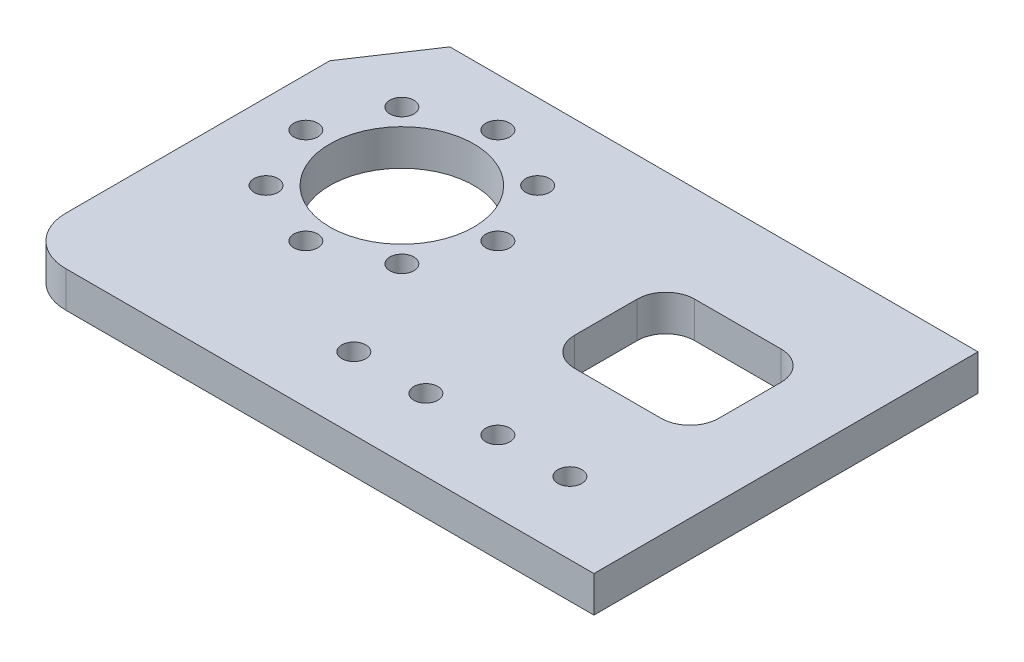
ISO-10303-21;
HEADER;
FILE_DESCRIPTION(('STEP AP214'),'2;1');
FILE_NAME('part.step','',(''),(''),'','','');
FILE_SCHEMA(('AUTOMOTIVE_DESIGN { 1 0 10303 214 1 1 1 1 }'));
ENDSEC;
DATA;
#1=APPLICATION_CONTEXT('core data for automotive mechanical design processes');
#2=APPLICATION_PROTOCOL_DEFINITION('international standard','automotive_design',2000,#1);
#3=PRODUCT_CONTEXT('',#1,'mechanical');
#4=PRODUCT('Part','Part','',(#3));
#5=PRODUCT_RELATED_PRODUCT_CATEGORY('part','',(#4));
#6=PRODUCT_DEFINITION_FORMATION('','',#4);
#7=PRODUCT_DEFINITION_CONTEXT('part definition',#1,'design');
#8=PRODUCT_DEFINITION('design','',#6,#7);
#9=PRODUCT_DEFINITION_SHAPE('','',#8);
#10=(LENGTH_UNIT() NAMED_UNIT(*) SI_UNIT(.MILLI.,.METRE.));
#11=(NAMED_UNIT(*) PLANE_ANGLE_UNIT() SI_UNIT($,.RADIAN.));
#12=(NAMED_UNIT(*) SI_UNIT($,.STERADIAN.) SOLID_ANGLE_UNIT());
#13=UNCERTAINTY_MEASURE_WITH_UNIT(LENGTH_MEASURE(1.E-05),#10,'distance_accuracy_value','');
#14=(GEOMETRIC_REPRESENTATION_CONTEXT(3) GLOBAL_UNCERTAINTY_ASSIGNED_CONTEXT((#13)) GLOBAL_UNIT_ASSIGNED_CONTEXT((#10,
#11,#12)) REPRESENTATION_CONTEXT('',''));
#15=CARTESIAN_POINT('',(0.,0.,0.));
#16=DIRECTION('',(0.,0.,1.));
#17=DIRECTION('',(1.,0.,0.));
#18=AXIS2_PLACEMENT_3D('',#15,#16,#17);
#19=CARTESIAN_POINT('',(12.7,9.525,88.9));
#20=DIRECTION('',(0.,1.,0.));
#21=DIRECTION('',(0.,0.,1.));
#22=AXIS2_PLACEMENT_3D('',#19,#20,#21);
#23=PLANE('',#22);
#24=CARTESIAN_POINT('',(127.,9.525,82.55));
#25=DIRECTION('',(0.,1.,0.));
#26=DIRECTION('',(0.,0.,1.));
#27=AXIS2_PLACEMENT_3D('',#24,#25,#26);
#28=CIRCLE('',#27,3.17499999999997);
#29=CARTESIAN_POINT('',(127.,9.525,85.725));
#30=VERTEX_POINT('',#29);
#31=EDGE_CURVE('E203',#30,#30,#28,.T.);
#32=ORIENTED_EDGE('',*,*,#31,.F.);
#33=EDGE_LOOP('',(#32));
#34=FACE_BOUND('',#33,.T.);
#35=CARTESIAN_POINT('',(88.9,9.525,82.55));
#36=DIRECTION('',(0.,1.,0.));
#37=DIRECTION('',(0.,0.,1.));
#38=AXIS2_PLACEMENT_3D('',#35,#36,#37);
#39=CIRCLE('',#38,3.175);
#40=CARTESIAN_POINT('',(88.9,9.525,85.725));
#41=VERTEX_POINT('',#40);
#42=EDGE_CURVE('E215',#41,#41,#39,.T.);
#43=ORIENTED_EDGE('',*,*,#42,.F.);
#44=EDGE_LOOP('',(#43));
#45=FACE_BOUND('',#44,.T.);
#46=CARTESIAN_POINT('',(56.0605122421383,9.525,20.1394877578617));
#47=DIRECTION('',(0.,1.,0.));
#48=DIRECTION('',(0.,0.,1.));
#49=AXIS2_PLACEMENT_3D('',#46,#47,#48);
#50=CIRCLE('',#49,3.175);
#51=CARTESIAN_POINT('',(56.0605122421383,9.525,23.3144877578617));
#52=VERTEX_POINT('',#51);
#53=EDGE_CURVE('E227',#52,#52,#50,.T.);
#54=ORIENTED_EDGE('',*,*,#53,.F.);
#55=EDGE_LOOP('',(#54));
#56=FACE_BOUND('',#55,.T.);
#57=CARTESIAN_POINT('',(20.1394877578617,9.525,20.1394877578617));
#58=DIRECTION('',(0.,1.,0.));
#59=DIRECTION('',(0.,0.,1.));
#60=AXIS2_PLACEMENT_3D('',#57,#58,#59);
#61=CIRCLE('',#60,3.175);
#62=CARTESIAN_POINT('',(20.1394877578617,9.525,23.3144877578617));
#63=VERTEX_POINT('',#62);
#64=EDGE_CURVE('E239',#63,#63,#61,.T.);
#65=ORIENTED_EDGE('',*,*,#64,.F.);
#66=EDGE_LOOP('',(#65));
#67=FACE_BOUND('',#66,.T.);
#68=CARTESIAN_POINT('',(20.1394877578617,9.525,56.0605122421383));
#69=DIRECTION('',(0.,1.,0.));
#70=DIRECTION('',(0.,0.,1.));
#71=AXIS2_PLACEMENT_3D('',#68,#69,#70);
#72=CIRCLE('',#71,3.175);
#73=CARTESIAN_POINT('',(20.1394877578617,9.525,59.2355122421383));
#74=VERTEX_POINT('',#73);
#75=EDGE_CURVE('E251',#74,#74,#72,.T.);
#76=ORIENTED_EDGE('',*,*,#75,.F.);
#77=EDGE_LOOP('',(#76));
#78=FACE_BOUND('',#77,.T.);
#79=CARTESIAN_POINT('',(69.85,9.525,82.55));
#80=DIRECTION('',(0.,1.,0.));
#81=DIRECTION('',(0.,0.,1.));
#82=AXIS2_PLACEMENT_3D('',#79,#80,#81);
#83=CIRCLE('',#82,3.175);
#84=CARTESIAN_POINT('',(69.85,9.525,85.725));
#85=VERTEX_POINT('',#84);
#86=EDGE_CURVE('E263',#85,#85,#83,.T.);
#87=ORIENTED_EDGE('',*,*,#86,.F.);
#88=EDGE_LOOP('',(#87));
#89=FACE_BOUND('',#88,.T.);
#90=CARTESIAN_POINT('',(38.1,9.525,38.1));
#91=DIRECTION('',(0.,1.,0.));
#92=DIRECTION('',(0.,0.,1.));
#93=AXIS2_PLACEMENT_3D('',#90,#91,#92);
#94=CIRCLE('',#93,19.05);
#95=CARTESIAN_POINT('',(38.1,9.525,57.15));
#96=VERTEX_POINT('',#95);
#97=EDGE_CURVE('E275',#96,#96,#94,.T.);
#98=ORIENTED_EDGE('',*,*,#97,.F.);
#99=EDGE_LOOP('',(#98));
#100=FACE_BOUND('',#99,.T.);
#101=DIRECTION('',(0.,0.,-1.));
#102=VECTOR('',#101,1.);
#103=CARTESIAN_POINT('',(152.4,9.525,0.));
#104=LINE('',#103,#102);
#105=CARTESIAN_POINT('',(152.4,9.525,101.6));
#106=VERTEX_POINT('',#105);
#107=CARTESIAN_POINT('',(152.4,9.525,0.));
#108=VERTEX_POINT('',#107);
#109=EDGE_CURVE('E281',#106,#108,#104,.T.);
#110=ORIENTED_EDGE('',*,*,#109,.T.);
#111=DIRECTION('',(-1.,0.,0.));
#112=VECTOR('',#111,1.);
#113=CARTESIAN_POINT('',(12.7,9.525,0.));
#114=LINE('',#113,#112);
#115=CARTESIAN_POINT('',(12.7,9.525,0.));
#116=VERTEX_POINT('',#115);
#117=EDGE_CURVE('E284',#108,#116,#114,.T.);
#118=ORIENTED_EDGE('',*,*,#117,.T.);
#119=DIRECTION('',(-0.554700196225229,0.,0.832050294337844));
#120=VECTOR('',#119,1.);
#121=CARTESIAN_POINT('',(0.,9.525,19.05));
#122=LINE('',#121,#120);
#123=CARTESIAN_POINT('',(0.,9.525,19.05));
#124=VERTEX_POINT('',#123);
#125=EDGE_CURVE('E287',#116,#124,#122,.T.);
#126=ORIENTED_EDGE('',*,*,#125,.T.);
#127=DIRECTION('',(0.,0.,1.));
#128=VECTOR('',#127,1.);
#129=CARTESIAN_POINT('',(0.,9.525,19.05));
#130=LINE('',#129,#128);
#131=CARTESIAN_POINT('',(0.,9.525,88.9));
#132=VERTEX_POINT('',#131);
#133=EDGE_CURVE('E289',#124,#132,#130,.T.);
#134=ORIENTED_EDGE('',*,*,#133,.T.);
#135=CARTESIAN_POINT('',(12.7,9.525,88.9));
#136=DIRECTION('',(0.,1.,0.));
#137=DIRECTION('',(0.,0.,1.));
#138=AXIS2_PLACEMENT_3D('',#135,#136,#137);
#139=CIRCLE('',#138,12.7);
#140=CARTESIAN_POINT('',(12.7,9.525,101.6));
#141=VERTEX_POINT('',#140);
#142=EDGE_CURVE('E291',#132,#141,#139,.T.);
#143=ORIENTED_EDGE('',*,*,#142,.T.);
#144=DIRECTION('',(1.,0.,0.));
#145=VECTOR('',#144,1.);
#146=CARTESIAN_POINT('',(12.7,9.525,101.6));
#147=LINE('',#146,#145);
#148=EDGE_CURVE('E293',#141,#106,#147,.T.);
#149=ORIENTED_EDGE('',*,*,#148,.T.);
#150=EDGE_LOOP('',(#110,#118,#126,#134,#143,#149));
#151=FACE_BOUND('',#150,.T.);
#152=CARTESIAN_POINT('',(56.0605122421383,9.525,56.0605122421383));
#153=DIRECTION('',(0.,1.,0.));
#154=DIRECTION('',(0.,0.,1.));
#155=AXIS2_PLACEMENT_3D('',#152,#153,#154);
#156=CIRCLE('',#155,3.175);
#157=CARTESIAN_POINT('',(56.0605122421383,9.525,59.2355122421383));
#158=VERTEX_POINT('',#157);
#159=EDGE_CURVE('E269',#158,#158,#156,.T.);
#160=ORIENTED_EDGE('',*,*,#159,.F.);
#161=EDGE_LOOP('',(#160));
#162=FACE_BOUND('',#161,.T.);
#163=CARTESIAN_POINT('',(38.1,9.525,63.5));
#164=DIRECTION('',(0.,1.,0.));
#165=DIRECTION('',(0.,0.,1.));
#166=AXIS2_PLACEMENT_3D('',#163,#164,#165);
#167=CIRCLE('',#166,3.175);
#168=CARTESIAN_POINT('',(38.1,9.525,66.675));
#169=VERTEX_POINT('',#168);
#170=EDGE_CURVE('E257',#169,#169,#167,.T.);
#171=ORIENTED_EDGE('',*,*,#170,.F.);
#172=EDGE_LOOP('',(#171));
#173=FACE_BOUND('',#172,.T.);
#174=CARTESIAN_POINT('',(12.7,9.525,38.1));
#175=DIRECTION('',(0.,1.,0.));
#176=DIRECTION('',(0.,0.,1.));
#177=AXIS2_PLACEMENT_3D('',#174,#175,#176);
#178=CIRCLE('',#177,3.175);
#179=CARTESIAN_POINT('',(12.7,9.525,41.275));
#180=VERTEX_POINT('',#179);
#181=EDGE_CURVE('E245',#180,#180,#178,.T.);
#182=ORIENTED_EDGE('',*,*,#181,.F.);
#183=EDGE_LOOP('',(#182));
#184=FACE_BOUND('',#183,.T.);
#185=CARTESIAN_POINT('',(38.1,9.525,12.7));
#186=DIRECTION('',(0.,1.,0.));
#187=DIRECTION('',(0.,0.,1.));
#188=AXIS2_PLACEMENT_3D('',#185,#186,#187);
#189=CIRCLE('',#188,3.175);
#190=CARTESIAN_POINT('',(38.1,9.525,15.875));
#191=VERTEX_POINT('',#190);
#192=EDGE_CURVE('E233',#191,#191,#189,.T.);
#193=ORIENTED_EDGE('',*,*,#192,.F.);
#194=EDGE_LOOP('',(#193));
#195=FACE_BOUND('',#194,.T.);
#196=CARTESIAN_POINT('',(63.5,9.525,38.1));
#197=DIRECTION('',(0.,1.,0.));
#198=DIRECTION('',(0.,0.,1.));
#199=AXIS2_PLACEMENT_3D('',#196,#197,#198);
#200=CIRCLE('',#199,3.175);
#201=CARTESIAN_POINT('',(63.5,9.525,41.275));
#202=VERTEX_POINT('',#201);
#203=EDGE_CURVE('E221',#202,#202,#200,.T.);
#204=ORIENTED_EDGE('',*,*,#203,.F.);
#205=EDGE_LOOP('',(#204));
#206=FACE_BOUND('',#205,.T.);
#207=CARTESIAN_POINT('',(107.95,9.525,82.55));
#208=DIRECTION('',(0.,1.,0.));
#209=DIRECTION('',(0.,0.,1.));
#210=AXIS2_PLACEMENT_3D('',#207,#208,#209);
#211=CIRCLE('',#210,3.175);
#212=CARTESIAN_POINT('',(107.95,9.525,85.725));
#213=VERTEX_POINT('',#212);
#214=EDGE_CURVE('E209',#213,#213,#211,.T.);
#215=ORIENTED_EDGE('',*,*,#214,.F.);
#216=EDGE_LOOP('',(#215));
#217=FACE_BOUND('',#216,.T.);
#218=DIRECTION('',(1.,0.,0.));
#219=VECTOR('',#218,1.);
#220=CARTESIAN_POINT('',(102.87,9.525,57.15));
#221=LINE('',#220,#219);
#222=CARTESIAN_POINT('',(102.87,9.525,57.15));
#223=VERTEX_POINT('',#222);
#224=CARTESIAN_POINT('',(125.73,9.525,57.15));
#225=VERTEX_POINT('',#224);
#226=EDGE_CURVE('E146',#223,#225,#221,.T.);
#227=ORIENTED_EDGE('',*,*,#226,.F.);
#228=CARTESIAN_POINT('',(102.87,9.525,49.53));
#229=DIRECTION('',(0.,1.,0.));
#230=DIRECTION('',(0.,0.,1.));
#231=AXIS2_PLACEMENT_3D('',#228,#229,#230);
#232=CIRCLE('',#231,7.62);
#233=CARTESIAN_POINT('',(95.25,9.525,49.53));
#234=VERTEX_POINT('',#233);
#235=EDGE_CURVE('E138',#234,#223,#232,.T.);
#236=ORIENTED_EDGE('',*,*,#235,.F.);
#237=DIRECTION('',(0.,0.,1.));
#238=VECTOR('',#237,1.);
#239=CARTESIAN_POINT('',(95.25,9.525,33.02));
#240=LINE('',#239,#238);
#241=CARTESIAN_POINT('',(95.25,9.525,33.02));
#242=VERTEX_POINT('',#241);
#243=EDGE_CURVE('E171',#242,#234,#240,.T.);
#244=ORIENTED_EDGE('',*,*,#243,.F.);
#245=CARTESIAN_POINT('',(102.87,9.525,33.02));
#246=DIRECTION('',(0.,1.,0.));
#247=DIRECTION('',(0.,0.,1.));
#248=AXIS2_PLACEMENT_3D('',#245,#246,#247);
#249=CIRCLE('',#248,7.62000000000001);
#250=CARTESIAN_POINT('',(102.87,9.525,25.4));
#251=VERTEX_POINT('',#250);
#252=EDGE_CURVE('E169',#251,#242,#249,.T.);
#253=ORIENTED_EDGE('',*,*,#252,.F.);
#254=DIRECTION('',(-1.,0.,0.));
#255=VECTOR('',#254,1.);
#256=CARTESIAN_POINT('',(102.87,9.525,25.4));
#257=LINE('',#256,#255);
#258=CARTESIAN_POINT('',(125.73,9.525,25.4));
#259=VERTEX_POINT('',#258);
#260=EDGE_CURVE('E167',#259,#251,#257,.T.);
#261=ORIENTED_EDGE('',*,*,#260,.F.);
#262=CARTESIAN_POINT('',(125.73,9.525,33.02));
#263=DIRECTION('',(0.,1.,0.));
#264=DIRECTION('',(0.,0.,-1.));
#265=AXIS2_PLACEMENT_3D('',#262,#263,#264);
#266=CIRCLE('',#265,7.62000000000001);
#267=CARTESIAN_POINT('',(133.35,9.525,33.02));
#268=VERTEX_POINT('',#267);
#269=EDGE_CURVE('E165',#268,#259,#266,.T.);
#270=ORIENTED_EDGE('',*,*,#269,.F.);
#271=DIRECTION('',(0.,0.,-1.));
#272=VECTOR('',#271,1.);
#273=CARTESIAN_POINT('',(133.35,9.525,33.02));
#274=LINE('',#273,#272);
#275=CARTESIAN_POINT('',(133.35,9.525,49.53));
#276=VERTEX_POINT('',#275);
#277=EDGE_CURVE('E161',#276,#268,#274,.T.);
#278=ORIENTED_EDGE('',*,*,#277,.F.);
#279=CARTESIAN_POINT('',(125.73,9.525,49.53));
#280=DIRECTION('',(0.,1.,0.));
#281=DIRECTION('',(0.,0.,1.));
#282=AXIS2_PLACEMENT_3D('',#279,#280,#281);
#283=CIRCLE('',#282,7.62000000000001);
#284=EDGE_CURVE('E159',#225,#276,#283,.T.);
#285=ORIENTED_EDGE('',*,*,#284,.F.);
#286=EDGE_LOOP('',(#227,#236,#244,#253,#261,#270,#278,#285));
#287=FACE_BOUND('',#286,.T.);
#288=ADVANCED_FACE('F37',(#34,#45,#56,#67,#78,#89,#100,#151,#162,#173,#184,#195,#206,#217,#287),
#23,.T.);
#289=CARTESIAN_POINT('',(12.7,0.,88.9));
#290=DIRECTION('',(0.,1.,0.));
#291=DIRECTION('',(0.,0.,1.));
#292=AXIS2_PLACEMENT_3D('',#289,#290,#291);
#293=PLANE('',#292);
#294=CARTESIAN_POINT('',(127.,0.,82.55));
#295=DIRECTION('',(0.,1.,0.));
#296=DIRECTION('',(0.,0.,1.));
#297=AXIS2_PLACEMENT_3D('',#294,#295,#296);
#298=CIRCLE('',#297,3.17499999999997);
#299=CARTESIAN_POINT('',(127.,0.,85.725));
#300=VERTEX_POINT('',#299);
#301=EDGE_CURVE('E154',#300,#300,#298,.T.);
#302=ORIENTED_EDGE('',*,*,#301,.T.);
#303=EDGE_LOOP('',(#302));
#304=FACE_BOUND('',#303,.T.);
#305=CARTESIAN_POINT('',(88.9,0.,82.55));
#306=DIRECTION('',(0.,1.,0.));
#307=DIRECTION('',(0.,0.,1.));
#308=AXIS2_PLACEMENT_3D('',#305,#306,#307);
#309=CIRCLE('',#308,3.175);
#310=CARTESIAN_POINT('',(88.9,0.,85.725));
#311=VERTEX_POINT('',#310);
#312=EDGE_CURVE('E212',#311,#311,#309,.T.);
#313=ORIENTED_EDGE('',*,*,#312,.T.);
#314=EDGE_LOOP('',(#313));
#315=FACE_BOUND('',#314,.T.);
#316=CARTESIAN_POINT('',(56.0605122421383,0.,20.1394877578617));
#317=DIRECTION('',(0.,1.,0.));
#318=DIRECTION('',(0.,0.,1.));
#319=AXIS2_PLACEMENT_3D('',#316,#317,#318);
#320=CIRCLE('',#319,3.175);
#321=CARTESIAN_POINT('',(56.0605122421383,0.,23.3144877578617));
#322=VERTEX_POINT('',#321);
#323=EDGE_CURVE('E224',#322,#322,#320,.T.);
#324=ORIENTED_EDGE('',*,*,#323,.T.);
#325=EDGE_LOOP('',(#324));
#326=FACE_BOUND('',#325,.T.);
#327=CARTESIAN_POINT('',(20.1394877578617,0.,20.1394877578617));
#328=DIRECTION('',(0.,1.,0.));
#329=DIRECTION('',(0.,0.,1.));
#330=AXIS2_PLACEMENT_3D('',#327,#328,#329);
#331=CIRCLE('',#330,3.175);
#332=CARTESIAN_POINT('',(20.1394877578617,0.,23.3144877578617));
#333=VERTEX_POINT('',#332);
#334=EDGE_CURVE('E236',#333,#333,#331,.T.);
#335=ORIENTED_EDGE('',*,*,#334,.T.);
#336=EDGE_LOOP('',(#335));
#337=FACE_BOUND('',#336,.T.);
#338=CARTESIAN_POINT('',(20.1394877578617,0.,56.0605122421383));
#339=DIRECTION('',(0.,1.,0.));
#340=DIRECTION('',(0.,0.,1.));
#341=AXIS2_PLACEMENT_3D('',#338,#339,#340);
#342=CIRCLE('',#341,3.175);
#343=CARTESIAN_POINT('',(20.1394877578617,0.,59.2355122421383));
#344=VERTEX_POINT('',#343);
#345=EDGE_CURVE('E248',#344,#344,#342,.T.);
#346=ORIENTED_EDGE('',*,*,#345,.T.);
#347=EDGE_LOOP('',(#346));
#348=FACE_BOUND('',#347,.T.);
#349=CARTESIAN_POINT('',(69.85,0.,82.55));
#350=DIRECTION('',(0.,1.,0.));
#351=DIRECTION('',(0.,0.,1.));
#352=AXIS2_PLACEMENT_3D('',#349,#350,#351);
#353=CIRCLE('',#352,3.175);
#354=CARTESIAN_POINT('',(69.85,0.,85.725));
#355=VERTEX_POINT('',#354);
#356=EDGE_CURVE('E260',#355,#355,#353,.T.);
#357=ORIENTED_EDGE('',*,*,#356,.T.);
#358=EDGE_LOOP('',(#357));
#359=FACE_BOUND('',#358,.T.);
#360=CARTESIAN_POINT('',(38.1,0.,38.1));
#361=DIRECTION('',(0.,1.,0.));
#362=DIRECTION('',(0.,0.,1.));
#363=AXIS2_PLACEMENT_3D('',#360,#361,#362);
#364=CIRCLE('',#363,19.05);
#365=CARTESIAN_POINT('',(38.1,0.,57.15));
#366=VERTEX_POINT('',#365);
#367=EDGE_CURVE('E272',#366,#366,#364,.T.);
#368=ORIENTED_EDGE('',*,*,#367,.T.);
#369=EDGE_LOOP('',(#368));
#370=FACE_BOUND('',#369,.T.);
#371=DIRECTION('',(0.,0.,-1.));
#372=VECTOR('',#371,1.);
#373=CARTESIAN_POINT('',(152.4,0.,0.));
#374=LINE('',#373,#372);
#375=CARTESIAN_POINT('',(152.4,0.,101.6));
#376=VERTEX_POINT('',#375);
#377=CARTESIAN_POINT('',(152.4,0.,0.));
#378=VERTEX_POINT('',#377);
#379=EDGE_CURVE('E278',#376,#378,#374,.T.);
#380=ORIENTED_EDGE('',*,*,#379,.F.);
#381=DIRECTION('',(1.,0.,0.));
#382=VECTOR('',#381,1.);
#383=CARTESIAN_POINT('',(12.7,0.,101.6));
#384=LINE('',#383,#382);
#385=CARTESIAN_POINT('',(12.7,0.,101.6));
#386=VERTEX_POINT('',#385);
#387=EDGE_CURVE('E285',#386,#376,#384,.T.);
#388=ORIENTED_EDGE('',*,*,#387,.F.);
#389=CARTESIAN_POINT('',(12.7,0.,88.9));
#390=DIRECTION('',(0.,1.,0.));
#391=DIRECTION('',(0.,0.,1.));
#392=AXIS2_PLACEMENT_3D('',#389,#390,#391);
#393=CIRCLE('',#392,12.7);
#394=CARTESIAN_POINT('',(0.,0.,88.9));
#395=VERTEX_POINT('',#394);
#396=EDGE_CURVE('E304',#395,#386,#393,.T.);
#397=ORIENTED_EDGE('',*,*,#396,.F.);
#398=DIRECTION('',(0.,0.,1.));
#399=VECTOR('',#398,1.);
#400=CARTESIAN_POINT('',(0.,0.,19.05));
#401=LINE('',#400,#399);
#402=CARTESIAN_POINT('',(0.,0.,19.05));
#403=VERTEX_POINT('',#402);
#404=EDGE_CURVE('E302',#403,#395,#401,.T.);
#405=ORIENTED_EDGE('',*,*,#404,.F.);
#406=DIRECTION('',(-0.554700196225229,0.,0.832050294337844));
#407=VECTOR('',#406,1.);
#408=CARTESIAN_POINT('',(0.,0.,19.05));
#409=LINE('',#408,#407);
#410=CARTESIAN_POINT('',(12.7,0.,0.));
#411=VERTEX_POINT('',#410);
#412=EDGE_CURVE('E300',#411,#403,#409,.T.);
#413=ORIENTED_EDGE('',*,*,#412,.F.);
#414=DIRECTION('',(-1.,0.,0.));
#415=VECTOR('',#414,1.);
#416=CARTESIAN_POINT('',(12.7,0.,0.));
#417=LINE('',#416,#415);
#418=EDGE_CURVE('E298',#378,#411,#417,.T.);
#419=ORIENTED_EDGE('',*,*,#418,.F.);
#420=EDGE_LOOP('',(#380,#388,#397,#405,#413,#419));
#421=FACE_BOUND('',#420,.T.);
#422=CARTESIAN_POINT('',(56.0605122421383,0.,56.0605122421383));
#423=DIRECTION('',(0.,1.,0.));
#424=DIRECTION('',(0.,0.,1.));
#425=AXIS2_PLACEMENT_3D('',#422,#423,#424);
#426=CIRCLE('',#425,3.175);
#427=CARTESIAN_POINT('',(56.0605122421383,0.,59.2355122421383));
#428=VERTEX_POINT('',#427);
#429=EDGE_CURVE('E266',#428,#428,#426,.T.);
#430=ORIENTED_EDGE('',*,*,#429,.T.);
#431=EDGE_LOOP('',(#430));
#432=FACE_BOUND('',#431,.T.);
#433=CARTESIAN_POINT('',(38.1,0.,63.5));
#434=DIRECTION('',(0.,1.,0.));
#435=DIRECTION('',(0.,0.,1.));
#436=AXIS2_PLACEMENT_3D('',#433,#434,#435);
#437=CIRCLE('',#436,3.175);
#438=CARTESIAN_POINT('',(38.1,0.,66.675));
#439=VERTEX_POINT('',#438);
#440=EDGE_CURVE('E254',#439,#439,#437,.T.);
#441=ORIENTED_EDGE('',*,*,#440,.T.);
#442=EDGE_LOOP('',(#441));
#443=FACE_BOUND('',#442,.T.);
#444=CARTESIAN_POINT('',(12.7,0.,38.1));
#445=DIRECTION('',(0.,1.,0.));
#446=DIRECTION('',(0.,0.,1.));
#447=AXIS2_PLACEMENT_3D('',#444,#445,#446);
#448=CIRCLE('',#447,3.175);
#449=CARTESIAN_POINT('',(12.7,0.,41.275));
#450=VERTEX_POINT('',#449);
#451=EDGE_CURVE('E242',#450,#450,#448,.T.);
#452=ORIENTED_EDGE('',*,*,#451,.T.);
#453=EDGE_LOOP('',(#452));
#454=FACE_BOUND('',#453,.T.);
#455=CARTESIAN_POINT('',(38.1,0.,12.7));
#456=DIRECTION('',(0.,1.,0.));
#457=DIRECTION('',(0.,0.,1.));
#458=AXIS2_PLACEMENT_3D('',#455,#456,#457);
#459=CIRCLE('',#458,3.175);
#460=CARTESIAN_POINT('',(38.1,0.,15.875));
#461=VERTEX_POINT('',#460);
#462=EDGE_CURVE('E230',#461,#461,#459,.T.);
#463=ORIENTED_EDGE('',*,*,#462,.T.);
#464=EDGE_LOOP('',(#463));
#465=FACE_BOUND('',#464,.T.);
#466=CARTESIAN_POINT('',(63.5,0.,38.1));
#467=DIRECTION('',(0.,1.,0.));
#468=DIRECTION('',(0.,0.,1.));
#469=AXIS2_PLACEMENT_3D('',#466,#467,#468);
#470=CIRCLE('',#469,3.175);
#471=CARTESIAN_POINT('',(63.5,0.,41.275));
#472=VERTEX_POINT('',#471);
#473=EDGE_CURVE('E218',#472,#472,#470,.T.);
#474=ORIENTED_EDGE('',*,*,#473,.T.);
#475=EDGE_LOOP('',(#474));
#476=FACE_BOUND('',#475,.T.);
#477=CARTESIAN_POINT('',(107.95,0.,82.55));
#478=DIRECTION('',(0.,1.,0.));
#479=DIRECTION('',(0.,0.,1.));
#480=AXIS2_PLACEMENT_3D('',#477,#478,#479);
#481=CIRCLE('',#480,3.175);
#482=CARTESIAN_POINT('',(107.95,0.,85.725));
#483=VERTEX_POINT('',#482);
#484=EDGE_CURVE('E206',#483,#483,#481,.T.);
#485=ORIENTED_EDGE('',*,*,#484,.T.);
#486=EDGE_LOOP('',(#485));
#487=FACE_BOUND('',#486,.T.);
#488=CARTESIAN_POINT('',(102.87,0.,49.53));
#489=DIRECTION('',(0.,1.,0.));
#490=DIRECTION('',(0.,0.,1.));
#491=AXIS2_PLACEMENT_3D('',#488,#489,#490);
#492=CIRCLE('',#491,7.62);
#493=CARTESIAN_POINT('',(95.25,0.,49.53));
#494=VERTEX_POINT('',#493);
#495=CARTESIAN_POINT('',(102.87,0.,57.15));
#496=VERTEX_POINT('',#495);
#497=EDGE_CURVE('E60',#494,#496,#492,.T.);
#498=ORIENTED_EDGE('',*,*,#497,.T.);
#499=DIRECTION('',(1.,0.,0.));
#500=VECTOR('',#499,1.);
#501=CARTESIAN_POINT('',(102.87,0.,57.15));
#502=LINE('',#501,#500);
#503=CARTESIAN_POINT('',(125.73,0.,57.15));
#504=VERTEX_POINT('',#503);
#505=EDGE_CURVE('E153',#496,#504,#502,.T.);
#506=ORIENTED_EDGE('',*,*,#505,.T.);
#507=CARTESIAN_POINT('',(125.73,0.,49.53));
#508=DIRECTION('',(0.,1.,0.));
#509=DIRECTION('',(0.,0.,1.));
#510=AXIS2_PLACEMENT_3D('',#507,#508,#509);
#511=CIRCLE('',#510,7.62000000000001);
#512=CARTESIAN_POINT('',(133.35,0.,49.53));
#513=VERTEX_POINT('',#512);
#514=EDGE_CURVE('E175',#504,#513,#511,.T.);
#515=ORIENTED_EDGE('',*,*,#514,.T.);
#516=DIRECTION('',(0.,0.,-1.));
#517=VECTOR('',#516,1.);
#518=CARTESIAN_POINT('',(133.35,0.,33.02));
#519=LINE('',#518,#517);
#520=CARTESIAN_POINT('',(133.35,0.,33.02));
#521=VERTEX_POINT('',#520);
#522=EDGE_CURVE('E178',#513,#521,#519,.T.);
#523=ORIENTED_EDGE('',*,*,#522,.T.);
#524=CARTESIAN_POINT('',(125.73,0.,33.02));
#525=DIRECTION('',(0.,1.,0.));
#526=DIRECTION('',(0.,0.,-1.));
#527=AXIS2_PLACEMENT_3D('',#524,#525,#526);
#528=CIRCLE('',#527,7.62000000000001);
#529=CARTESIAN_POINT('',(125.73,0.,25.4));
#530=VERTEX_POINT('',#529);
#531=EDGE_CURVE('E181',#521,#530,#528,.T.);
#532=ORIENTED_EDGE('',*,*,#531,.T.);
#533=DIRECTION('',(-1.,0.,0.));
#534=VECTOR('',#533,1.);
#535=CARTESIAN_POINT('',(102.87,0.,25.4));
#536=LINE('',#535,#534);
#537=CARTESIAN_POINT('',(102.87,0.,25.4));
#538=VERTEX_POINT('',#537);
#539=EDGE_CURVE('E184',#530,#538,#536,.T.);
#540=ORIENTED_EDGE('',*,*,#539,.T.);
#541=CARTESIAN_POINT('',(102.87,0.,33.02));
#542=DIRECTION('',(0.,1.,0.));
#543=DIRECTION('',(0.,0.,1.));
#544=AXIS2_PLACEMENT_3D('',#541,#542,#543);
#545=CIRCLE('',#544,7.62000000000001);
#546=CARTESIAN_POINT('',(95.25,0.,33.02));
#547=VERTEX_POINT('',#546);
#548=EDGE_CURVE('E187',#538,#547,#545,.T.);
#549=ORIENTED_EDGE('',*,*,#548,.T.);
#550=DIRECTION('',(0.,0.,1.));
#551=VECTOR('',#550,1.);
#552=CARTESIAN_POINT('',(95.25,0.,33.02));
#553=LINE('',#552,#551);
#554=EDGE_CURVE('E147',#547,#494,#553,.T.);
#555=ORIENTED_EDGE('',*,*,#554,.T.);
#556=EDGE_LOOP('',(#498,#506,#515,#523,#532,#540,#549,#555));
#557=FACE_BOUND('',#556,.T.);
#558=ADVANCED_FACE('F328',(#304,#315,#326,#337,#348,#359,#370,#421,#432,#443,#454,#465,#476,
#487,#557),#293,.F.);
#559=CARTESIAN_POINT('',(152.4,9.525,0.));
#560=DIRECTION('',(-1.,0.,0.));
#561=DIRECTION('',(0.,0.,1.));
#562=AXIS2_PLACEMENT_3D('',#559,#560,#561);
#563=PLANE('',#562);
#564=ORIENTED_EDGE('',*,*,#379,.T.);
#565=DIRECTION('',(0.,-1.,0.));
#566=VECTOR('',#565,1.);
#567=CARTESIAN_POINT('',(152.4,9.525,0.));
#568=LINE('',#567,#566);
#569=EDGE_CURVE('E11',#108,#378,#568,.T.);
#570=ORIENTED_EDGE('',*,*,#569,.F.);
#571=ORIENTED_EDGE('',*,*,#109,.F.);
#572=DIRECTION('',(0.,-1.,0.));
#573=VECTOR('',#572,1.);
#574=CARTESIAN_POINT('',(152.4,9.525,101.6));
#575=LINE('',#574,#573);
#576=EDGE_CURVE('E295',#106,#376,#575,.T.);
#577=ORIENTED_EDGE('',*,*,#576,.T.);
#578=EDGE_LOOP('',(#564,#570,#571,#577));
#579=FACE_BOUND('',#578,.T.);
#580=ADVANCED_FACE('F39',(#579),#563,.F.);
#581=CARTESIAN_POINT('',(12.7,9.525,0.));
#582=DIRECTION('',(0.,0.,1.));
#583=DIRECTION('',(1.,0.,0.));
#584=AXIS2_PLACEMENT_3D('',#581,#582,#583);
#585=PLANE('',#584);
#586=ORIENTED_EDGE('',*,*,#418,.T.);
#587=DIRECTION('',(0.,-1.,0.));
#588=VECTOR('',#587,1.);
#589=CARTESIAN_POINT('',(12.7,9.525,0.));
#590=LINE('',#589,#588);
#591=EDGE_CURVE('E45',#116,#411,#590,.T.);
#592=ORIENTED_EDGE('',*,*,#591,.F.);
#593=ORIENTED_EDGE('',*,*,#117,.F.);
#594=ORIENTED_EDGE('',*,*,#569,.T.);
#595=EDGE_LOOP('',(#586,#592,#593,#594));
#596=FACE_BOUND('',#595,.T.);
#597=ADVANCED_FACE('F346',(#596),#585,.F.);
#598=CARTESIAN_POINT('',(0.,9.525,19.05));
#599=DIRECTION('',(0.832050294337844,0.,0.554700196225229));
#600=DIRECTION('',(0.554700196225229,0.,-0.832050294337844));
#601=AXIS2_PLACEMENT_3D('',#598,#599,#600);
#602=PLANE('',#601);
#603=ORIENTED_EDGE('',*,*,#412,.T.);
#604=DIRECTION('',(0.,-1.,0.));
#605=VECTOR('',#604,1.);
#606=CARTESIAN_POINT('',(0.,9.525,19.05));
#607=LINE('',#606,#605);
#608=EDGE_CURVE('E315',#124,#403,#607,.T.);
#609=ORIENTED_EDGE('',*,*,#608,.F.);
#610=ORIENTED_EDGE('',*,*,#125,.F.);
#611=ORIENTED_EDGE('',*,*,#591,.T.);
#612=EDGE_LOOP('',(#603,#609,#610,#611));
#613=FACE_BOUND('',#612,.T.);
#614=ADVANCED_FACE('F322',(#613),#602,.F.);
#615=CARTESIAN_POINT('',(0.,9.525,19.05));
#616=DIRECTION('',(1.,0.,0.));
#617=DIRECTION('',(0.,0.,-1.));
#618=AXIS2_PLACEMENT_3D('',#615,#616,#617);
#619=PLANE('',#618);
#620=ORIENTED_EDGE('',*,*,#404,.T.);
#621=DIRECTION('',(0.,-1.,0.));
#622=VECTOR('',#621,1.);
#623=CARTESIAN_POINT('',(0.,9.525,88.9));
#624=LINE('',#623,#622);
#625=EDGE_CURVE('E312',#132,#395,#624,.T.);
#626=ORIENTED_EDGE('',*,*,#625,.F.);
#627=ORIENTED_EDGE('',*,*,#133,.F.);
#628=ORIENTED_EDGE('',*,*,#608,.T.);
#629=EDGE_LOOP('',(#620,#626,#627,#628));
#630=FACE_BOUND('',#629,.T.);
#631=ADVANCED_FACE('F334',(#630),#619,.F.);
#632=CARTESIAN_POINT('',(12.7,9.525,88.9));
#633=DIRECTION('',(0.,-1.,0.));
#634=DIRECTION('',(0.,0.,-1.));
#635=AXIS2_PLACEMENT_3D('',#632,#633,#634);
#636=CYLINDRICAL_SURFACE('',#635,12.7);
#637=ORIENTED_EDGE('',*,*,#396,.T.);
#638=DIRECTION('',(0.,-1.,0.));
#639=VECTOR('',#638,1.);
#640=CARTESIAN_POINT('',(12.7,9.525,101.6));
#641=LINE('',#640,#639);
#642=EDGE_CURVE('E309',#141,#386,#641,.T.);
#643=ORIENTED_EDGE('',*,*,#642,.F.);
#644=ORIENTED_EDGE('',*,*,#142,.F.);
#645=ORIENTED_EDGE('',*,*,#625,.T.);
#646=EDGE_LOOP('',(#637,#643,#644,#645));
#647=FACE_BOUND('',#646,.T.);
#648=ADVANCED_FACE('F338',(#647),#636,.T.);
#649=CARTESIAN_POINT('',(12.7,9.525,101.6));
#650=DIRECTION('',(0.,0.,-1.));
#651=DIRECTION('',(-1.,0.,0.));
#652=AXIS2_PLACEMENT_3D('',#649,#650,#651);
#653=PLANE('',#652);
#654=ORIENTED_EDGE('',*,*,#387,.T.);
#655=ORIENTED_EDGE('',*,*,#576,.F.);
#656=ORIENTED_EDGE('',*,*,#148,.F.);
#657=ORIENTED_EDGE('',*,*,#642,.T.);
#658=EDGE_LOOP('',(#654,#655,#656,#657));
#659=FACE_BOUND('',#658,.T.);
#660=ADVANCED_FACE('F349',(#659),#653,.F.);
#661=CARTESIAN_POINT('',(38.1,9.525,38.1));
#662=DIRECTION('',(0.,-1.,0.));
#663=DIRECTION('',(0.,0.,-1.));
#664=AXIS2_PLACEMENT_3D('',#661,#662,#663);
#665=CYLINDRICAL_SURFACE('',#664,19.05);
#666=ORIENTED_EDGE('',*,*,#97,.T.);
#667=EDGE_LOOP('',(#666));
#668=FACE_BOUND('',#667,.T.);
#669=ORIENTED_EDGE('',*,*,#367,.F.);
#670=EDGE_LOOP('',(#669));
#671=FACE_BOUND('',#670,.T.);
#672=ADVANCED_FACE('F351',(#668,#671),#665,.F.);
#673=CARTESIAN_POINT('',(56.0605122421383,9.525,56.0605122421383));
#674=DIRECTION('',(0.,-1.,0.));
#675=DIRECTION('',(0.,0.,-1.));
#676=AXIS2_PLACEMENT_3D('',#673,#674,#675);
#677=CYLINDRICAL_SURFACE('',#676,3.175);
#678=ORIENTED_EDGE('',*,*,#159,.T.);
#679=EDGE_LOOP('',(#678));
#680=FACE_BOUND('',#679,.T.);
#681=ORIENTED_EDGE('',*,*,#429,.F.);
#682=EDGE_LOOP('',(#681));
#683=FACE_BOUND('',#682,.T.);
#684=ADVANCED_FACE('F357',(#680,#683),#677,.F.);
#685=CARTESIAN_POINT('',(69.85,9.525,82.55));
#686=DIRECTION('',(0.,-1.,0.));
#687=DIRECTION('',(0.,0.,-1.));
#688=AXIS2_PLACEMENT_3D('',#685,#686,#687);
#689=CYLINDRICAL_SURFACE('',#688,3.175);
#690=ORIENTED_EDGE('',*,*,#86,.T.);
#691=EDGE_LOOP('',(#690));
#692=FACE_BOUND('',#691,.T.);
#693=ORIENTED_EDGE('',*,*,#356,.F.);
#694=EDGE_LOOP('',(#693));
#695=FACE_BOUND('',#694,.T.);
#696=ADVANCED_FACE('F374',(#692,#695),#689,.F.);
#697=CARTESIAN_POINT('',(38.1,9.525,63.5));
#698=DIRECTION('',(0.,-1.,0.));
#699=DIRECTION('',(0.,0.,-1.));
#700=AXIS2_PLACEMENT_3D('',#697,#698,#699);
#701=CYLINDRICAL_SURFACE('',#700,3.175);
#702=ORIENTED_EDGE('',*,*,#170,.T.);
#703=EDGE_LOOP('',(#702));
#704=FACE_BOUND('',#703,.T.);
#705=ORIENTED_EDGE('',*,*,#440,.F.);
#706=EDGE_LOOP('',(#705));
#707=FACE_BOUND('',#706,.T.);
#708=ADVANCED_FACE('F378',(#704,#707),#701,.F.);
#709=CARTESIAN_POINT('',(20.1394877578617,9.525,56.0605122421383));
#710=DIRECTION('',(0.,-1.,0.));
#711=DIRECTION('',(0.,0.,-1.));
#712=AXIS2_PLACEMENT_3D('',#709,#710,#711);
#713=CYLINDRICAL_SURFACE('',#712,3.175);
#714=ORIENTED_EDGE('',*,*,#75,.T.);
#715=EDGE_LOOP('',(#714));
#716=FACE_BOUND('',#715,.T.);
#717=ORIENTED_EDGE('',*,*,#345,.F.);
#718=EDGE_LOOP('',(#717));
#719=FACE_BOUND('',#718,.T.);
#720=ADVANCED_FACE('F382',(#716,#719),#713,.F.);
#721=CARTESIAN_POINT('',(12.7,9.525,38.1));
#722=DIRECTION('',(0.,-1.,0.));
#723=DIRECTION('',(0.,0.,-1.));
#724=AXIS2_PLACEMENT_3D('',#721,#722,#723);
#725=CYLINDRICAL_SURFACE('',#724,3.175);
#726=ORIENTED_EDGE('',*,*,#181,.T.);
#727=EDGE_LOOP('',(#726));
#728=FACE_BOUND('',#727,.T.);
#729=ORIENTED_EDGE('',*,*,#451,.F.);
#730=EDGE_LOOP('',(#729));
#731=FACE_BOUND('',#730,.T.);
#732=ADVANCED_FACE('F386',(#728,#731),#725,.F.);
#733=CARTESIAN_POINT('',(20.1394877578617,9.525,20.1394877578617));
#734=DIRECTION('',(0.,-1.,0.));
#735=DIRECTION('',(0.,0.,-1.));
#736=AXIS2_PLACEMENT_3D('',#733,#734,#735);
#737=CYLINDRICAL_SURFACE('',#736,3.175);
#738=ORIENTED_EDGE('',*,*,#64,.T.);
#739=EDGE_LOOP('',(#738));
#740=FACE_BOUND('',#739,.T.);
#741=ORIENTED_EDGE('',*,*,#334,.F.);
#742=EDGE_LOOP('',(#741));
#743=FACE_BOUND('',#742,.T.);
#744=ADVANCED_FACE('F390',(#740,#743),#737,.F.);
#745=CARTESIAN_POINT('',(38.1,9.525,12.7));
#746=DIRECTION('',(0.,-1.,0.));
#747=DIRECTION('',(0.,0.,-1.));
#748=AXIS2_PLACEMENT_3D('',#745,#746,#747);
#749=CYLINDRICAL_SURFACE('',#748,3.175);
#750=ORIENTED_EDGE('',*,*,#192,.T.);
#751=EDGE_LOOP('',(#750));
#752=FACE_BOUND('',#751,.T.);
#753=ORIENTED_EDGE('',*,*,#462,.F.);
#754=EDGE_LOOP('',(#753));
#755=FACE_BOUND('',#754,.T.);
#756=ADVANCED_FACE('F394',(#752,#755),#749,.F.);
#757=CARTESIAN_POINT('',(56.0605122421383,9.525,20.1394877578617));
#758=DIRECTION('',(0.,-1.,0.));
#759=DIRECTION('',(0.,0.,-1.));
#760=AXIS2_PLACEMENT_3D('',#757,#758,#759);
#761=CYLINDRICAL_SURFACE('',#760,3.175);
#762=ORIENTED_EDGE('',*,*,#53,.T.);
#763=EDGE_LOOP('',(#762));
#764=FACE_BOUND('',#763,.T.);
#765=ORIENTED_EDGE('',*,*,#323,.F.);
#766=EDGE_LOOP('',(#765));
#767=FACE_BOUND('',#766,.T.);
#768=ADVANCED_FACE('F398',(#764,#767),#761,.F.);
#769=CARTESIAN_POINT('',(63.5,9.525,38.1));
#770=DIRECTION('',(0.,-1.,0.));
#771=DIRECTION('',(0.,0.,-1.));
#772=AXIS2_PLACEMENT_3D('',#769,#770,#771);
#773=CYLINDRICAL_SURFACE('',#772,3.175);
#774=ORIENTED_EDGE('',*,*,#203,.T.);
#775=EDGE_LOOP('',(#774));
#776=FACE_BOUND('',#775,.T.);
#777=ORIENTED_EDGE('',*,*,#473,.F.);
#778=EDGE_LOOP('',(#777));
#779=FACE_BOUND('',#778,.T.);
#780=ADVANCED_FACE('F402',(#776,#779),#773,.F.);
#781=CARTESIAN_POINT('',(88.9,9.525,82.55));
#782=DIRECTION('',(0.,-1.,0.));
#783=DIRECTION('',(0.,0.,-1.));
#784=AXIS2_PLACEMENT_3D('',#781,#782,#783);
#785=CYLINDRICAL_SURFACE('',#784,3.175);
#786=ORIENTED_EDGE('',*,*,#42,.T.);
#787=EDGE_LOOP('',(#786));
#788=FACE_BOUND('',#787,.T.);
#789=ORIENTED_EDGE('',*,*,#312,.F.);
#790=EDGE_LOOP('',(#789));
#791=FACE_BOUND('',#790,.T.);
#792=ADVANCED_FACE('F406',(#788,#791),#785,.F.);
#793=CARTESIAN_POINT('',(107.95,9.525,82.55));
#794=DIRECTION('',(0.,-1.,0.));
#795=DIRECTION('',(0.,0.,-1.));
#796=AXIS2_PLACEMENT_3D('',#793,#794,#795);
#797=CYLINDRICAL_SURFACE('',#796,3.175);
#798=ORIENTED_EDGE('',*,*,#214,.T.);
#799=EDGE_LOOP('',(#798));
#800=FACE_BOUND('',#799,.T.);
#801=ORIENTED_EDGE('',*,*,#484,.F.);
#802=EDGE_LOOP('',(#801));
#803=FACE_BOUND('',#802,.T.);
#804=ADVANCED_FACE('F410',(#800,#803),#797,.F.);
#805=CARTESIAN_POINT('',(127.,9.525,82.55));
#806=DIRECTION('',(0.,-1.,0.));
#807=DIRECTION('',(0.,0.,-1.));
#808=AXIS2_PLACEMENT_3D('',#805,#806,#807);
#809=CYLINDRICAL_SURFACE('',#808,3.17499999999997);
#810=ORIENTED_EDGE('',*,*,#31,.T.);
#811=EDGE_LOOP('',(#810));
#812=FACE_BOUND('',#811,.T.);
#813=ORIENTED_EDGE('',*,*,#301,.F.);
#814=EDGE_LOOP('',(#813));
#815=FACE_BOUND('',#814,.T.);
#816=ADVANCED_FACE('F414',(#812,#815),#809,.F.);
#817=CARTESIAN_POINT('',(102.87,9.525,49.53));
#818=DIRECTION('',(0.,-1.,0.));
#819=DIRECTION('',(0.,0.,-1.));
#820=AXIS2_PLACEMENT_3D('',#817,#818,#819);
#821=CYLINDRICAL_SURFACE('',#820,7.62);
#822=ORIENTED_EDGE('',*,*,#497,.F.);
#823=DIRECTION('',(0.,-1.,0.));
#824=VECTOR('',#823,1.);
#825=CARTESIAN_POINT('',(95.25,9.525,49.53));
#826=LINE('',#825,#824);
#827=EDGE_CURVE('E142',#234,#494,#826,.T.);
#828=ORIENTED_EDGE('',*,*,#827,.F.);
#829=ORIENTED_EDGE('',*,*,#235,.T.);
#830=DIRECTION('',(0.,-1.,0.));
#831=VECTOR('',#830,1.);
#832=CARTESIAN_POINT('',(102.87,9.525,57.15));
#833=LINE('',#832,#831);
#834=EDGE_CURVE('E141',#223,#496,#833,.T.);
#835=ORIENTED_EDGE('',*,*,#834,.T.);
#836=EDGE_LOOP('',(#822,#828,#829,#835));
#837=FACE_BOUND('',#836,.T.);
#838=ADVANCED_FACE('F140',(#837),#821,.F.);
#839=CARTESIAN_POINT('',(102.87,9.525,57.15));
#840=DIRECTION('',(0.,0.,-1.));
#841=DIRECTION('',(-1.,0.,0.));
#842=AXIS2_PLACEMENT_3D('',#839,#840,#841);
#843=PLANE('',#842);
#844=ORIENTED_EDGE('',*,*,#505,.F.);
#845=ORIENTED_EDGE('',*,*,#834,.F.);
#846=ORIENTED_EDGE('',*,*,#226,.T.);
#847=DIRECTION('',(0.,-1.,0.));
#848=VECTOR('',#847,1.);
#849=CARTESIAN_POINT('',(125.73,9.525,57.15));
#850=LINE('',#849,#848);
#851=EDGE_CURVE('E155',#225,#504,#850,.T.);
#852=ORIENTED_EDGE('',*,*,#851,.T.);
#853=EDGE_LOOP('',(#844,#845,#846,#852));
#854=FACE_BOUND('',#853,.T.);
#855=ADVANCED_FACE('F150',(#854),#843,.T.);
#856=CARTESIAN_POINT('',(125.73,9.525,49.53));
#857=DIRECTION('',(0.,-1.,0.));
#858=DIRECTION('',(0.,0.,-1.));
#859=AXIS2_PLACEMENT_3D('',#856,#857,#858);
#860=CYLINDRICAL_SURFACE('',#859,7.62000000000001);
#861=ORIENTED_EDGE('',*,*,#514,.F.);
#862=ORIENTED_EDGE('',*,*,#851,.F.);
#863=ORIENTED_EDGE('',*,*,#284,.T.);
#864=DIRECTION('',(0.,-1.,0.));
#865=VECTOR('',#864,1.);
#866=CARTESIAN_POINT('',(133.35,9.525,49.53));
#867=LINE('',#866,#865);
#868=EDGE_CURVE('E200',#276,#513,#867,.T.);
#869=ORIENTED_EDGE('',*,*,#868,.T.);
#870=EDGE_LOOP('',(#861,#862,#863,#869));
#871=FACE_BOUND('',#870,.T.);
#872=ADVANCED_FACE('F423',(#871),#860,.F.);
#873=CARTESIAN_POINT('',(133.35,9.525,33.02));
#874=DIRECTION('',(-1.,0.,0.));
#875=DIRECTION('',(0.,0.,1.));
#876=AXIS2_PLACEMENT_3D('',#873,#874,#875);
#877=PLANE('',#876);
#878=ORIENTED_EDGE('',*,*,#522,.F.);
#879=ORIENTED_EDGE('',*,*,#868,.F.);
#880=ORIENTED_EDGE('',*,*,#277,.T.);
#881=DIRECTION('',(0.,-1.,0.));
#882=VECTOR('',#881,1.);
#883=CARTESIAN_POINT('',(133.35,9.525,33.02));
#884=LINE('',#883,#882);
#885=EDGE_CURVE('E198',#268,#521,#884,.T.);
#886=ORIENTED_EDGE('',*,*,#885,.T.);
#887=EDGE_LOOP('',(#878,#879,#880,#886));
#888=FACE_BOUND('',#887,.T.);
#889=ADVANCED_FACE('F426',(#888),#877,.T.);
#890=CARTESIAN_POINT('',(125.73,9.525,33.02));
#891=DIRECTION('',(0.,-1.,0.));
#892=DIRECTION('',(0.,0.,-1.));
#893=AXIS2_PLACEMENT_3D('',#890,#891,#892);
#894=CYLINDRICAL_SURFACE('',#893,7.62000000000001);
#895=ORIENTED_EDGE('',*,*,#531,.F.);
#896=ORIENTED_EDGE('',*,*,#885,.F.);
#897=ORIENTED_EDGE('',*,*,#269,.T.);
#898=DIRECTION('',(0.,-1.,0.));
#899=VECTOR('',#898,1.);
#900=CARTESIAN_POINT('',(125.73,9.525,25.4));
#901=LINE('',#900,#899);
#902=EDGE_CURVE('E196',#259,#530,#901,.T.);
#903=ORIENTED_EDGE('',*,*,#902,.T.);
#904=EDGE_LOOP('',(#895,#896,#897,#903));
#905=FACE_BOUND('',#904,.T.);
#906=ADVANCED_FACE('F430',(#905),#894,.F.);
#907=CARTESIAN_POINT('',(102.87,9.525,25.4));
#908=DIRECTION('',(0.,0.,1.));
#909=DIRECTION('',(1.,0.,0.));
#910=AXIS2_PLACEMENT_3D('',#907,#908,#909);
#911=PLANE('',#910);
#912=ORIENTED_EDGE('',*,*,#539,.F.);
#913=ORIENTED_EDGE('',*,*,#902,.F.);
#914=ORIENTED_EDGE('',*,*,#260,.T.);
#915=DIRECTION('',(0.,-1.,0.));
#916=VECTOR('',#915,1.);
#917=CARTESIAN_POINT('',(102.87,9.525,25.4));
#918=LINE('',#917,#916);
#919=EDGE_CURVE('E194',#251,#538,#918,.T.);
#920=ORIENTED_EDGE('',*,*,#919,.T.);
#921=EDGE_LOOP('',(#912,#913,#914,#920));
#922=FACE_BOUND('',#921,.T.);
#923=ADVANCED_FACE('F434',(#922),#911,.T.);
#924=CARTESIAN_POINT('',(102.87,9.525,33.02));
#925=DIRECTION('',(0.,-1.,0.));
#926=DIRECTION('',(0.,0.,-1.));
#927=AXIS2_PLACEMENT_3D('',#924,#925,#926);
#928=CYLINDRICAL_SURFACE('',#927,7.62000000000001);
#929=ORIENTED_EDGE('',*,*,#548,.F.);
#930=ORIENTED_EDGE('',*,*,#919,.F.);
#931=ORIENTED_EDGE('',*,*,#252,.T.);
#932=DIRECTION('',(0.,-1.,0.));
#933=VECTOR('',#932,1.);
#934=CARTESIAN_POINT('',(95.25,9.525,33.02));
#935=LINE('',#934,#933);
#936=EDGE_CURVE('E52',#242,#547,#935,.T.);
#937=ORIENTED_EDGE('',*,*,#936,.T.);
#938=EDGE_LOOP('',(#929,#930,#931,#937));
#939=FACE_BOUND('',#938,.T.);
#940=ADVANCED_FACE('F438',(#939),#928,.F.);
#941=CARTESIAN_POINT('',(95.25,9.525,33.02));
#942=DIRECTION('',(1.,0.,0.));
#943=DIRECTION('',(0.,0.,-1.));
#944=AXIS2_PLACEMENT_3D('',#941,#942,#943);
#945=PLANE('',#944);
#946=ORIENTED_EDGE('',*,*,#554,.F.);
#947=ORIENTED_EDGE('',*,*,#936,.F.);
#948=ORIENTED_EDGE('',*,*,#243,.T.);
#949=ORIENTED_EDGE('',*,*,#827,.T.);
#950=EDGE_LOOP('',(#946,#947,#948,#949));
#951=FACE_BOUND('',#950,.T.);
#952=ADVANCED_FACE('F442',(#951),#945,.T.);
#953=CLOSED_SHELL('',(#288,#558,#580,#597,#614,#631,#648,#660,#672,#684,#696,#708,#720,#732,
#744,#756,#768,#780,#792,#804,#816,#838,#855,#872,#889,#906,#923,#940,#952));
#954=MANIFOLD_SOLID_BREP('B2',#953);
#955=ADVANCED_BREP_SHAPE_REPRESENTATION('',(#18,#954),#14);
#956=SHAPE_DEFINITION_REPRESENTATION(#9,#955);
ENDSEC;
END-ISO-10303-21;
